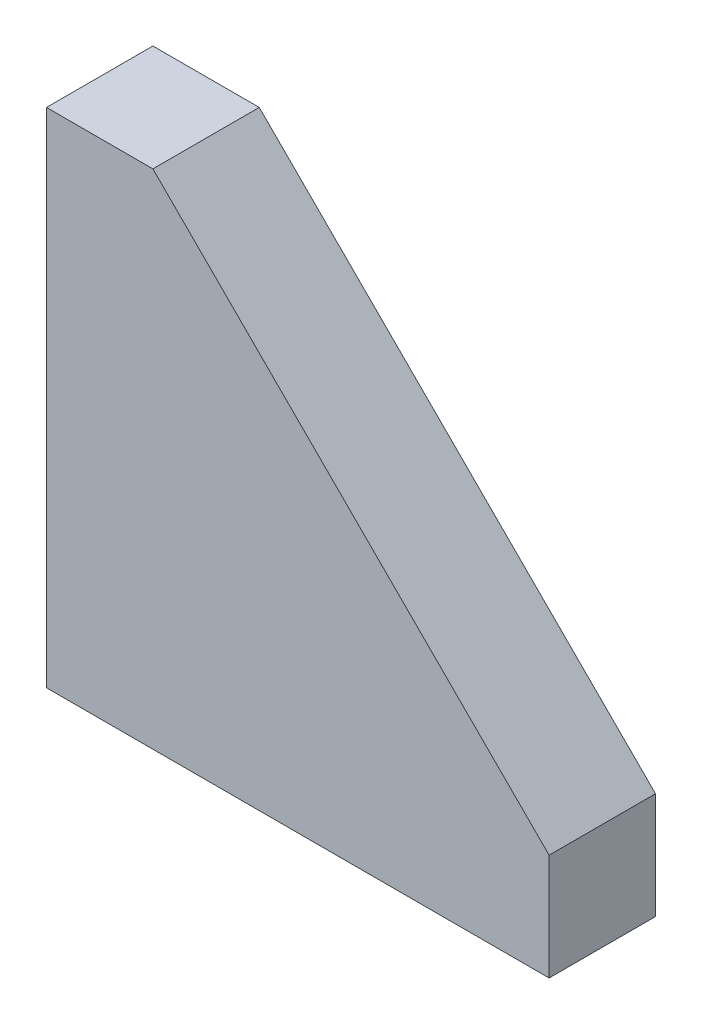
ISO-10303-21;
HEADER;
FILE_DESCRIPTION(('STEP AP214'),'2;1');
FILE_NAME('part.step','',(''),(''),'','','');
FILE_SCHEMA(('AUTOMOTIVE_DESIGN { 1 0 10303 214 1 1 1 1 }'));
ENDSEC;
DATA;
#1=APPLICATION_CONTEXT('core data for automotive mechanical design processes');
#2=APPLICATION_PROTOCOL_DEFINITION('international standard','automotive_design',2000,#1);
#3=PRODUCT_CONTEXT('',#1,'mechanical');
#4=PRODUCT('Part','Part','',(#3));
#5=PRODUCT_RELATED_PRODUCT_CATEGORY('part','',(#4));
#6=PRODUCT_DEFINITION_FORMATION('','',#4);
#7=PRODUCT_DEFINITION_CONTEXT('part definition',#1,'design');
#8=PRODUCT_DEFINITION('design','',#6,#7);
#9=PRODUCT_DEFINITION_SHAPE('','',#8);
#10=(LENGTH_UNIT() NAMED_UNIT(*) SI_UNIT(.MILLI.,.METRE.));
#11=(NAMED_UNIT(*) PLANE_ANGLE_UNIT() SI_UNIT($,.RADIAN.));
#12=(NAMED_UNIT(*) SI_UNIT($,.STERADIAN.) SOLID_ANGLE_UNIT());
#13=UNCERTAINTY_MEASURE_WITH_UNIT(LENGTH_MEASURE(1.E-05),#10,'distance_accuracy_value','');
#14=(GEOMETRIC_REPRESENTATION_CONTEXT(3) GLOBAL_UNCERTAINTY_ASSIGNED_CONTEXT((#13)) GLOBAL_UNIT_ASSIGNED_CONTEXT((#10,
#11,#12)) REPRESENTATION_CONTEXT('',''));
#15=CARTESIAN_POINT('',(0.,0.,0.));
#16=DIRECTION('',(0.,0.,1.));
#17=DIRECTION('',(1.,0.,0.));
#18=AXIS2_PLACEMENT_3D('',#15,#16,#17);
#19=CARTESIAN_POINT('',(30.,0.,6.35));
#20=DIRECTION('',(0.,1.,0.));
#21=DIRECTION('',(-1.,0.,0.));
#22=AXIS2_PLACEMENT_3D('',#19,#20,#21);
#23=PLANE('',#22);
#24=DIRECTION('',(1.,0.,0.));
#25=VECTOR('',#24,1.);
#26=CARTESIAN_POINT('',(30.,0.,0.));
#27=LINE('',#26,#25);
#28=CARTESIAN_POINT('',(0.,0.,0.));
#29=VERTEX_POINT('',#28);
#30=CARTESIAN_POINT('',(30.,0.,0.));
#31=VERTEX_POINT('',#30);
#32=EDGE_CURVE('E109',#29,#31,#27,.T.);
#33=ORIENTED_EDGE('',*,*,#32,.T.);
#34=DIRECTION('',(0.,0.,-1.));
#35=VECTOR('',#34,1.);
#36=CARTESIAN_POINT('',(30.,0.,6.35));
#37=LINE('',#36,#35);
#38=CARTESIAN_POINT('',(30.,0.,6.35));
#39=VERTEX_POINT('',#38);
#40=EDGE_CURVE('E11',#39,#31,#37,.T.);
#41=ORIENTED_EDGE('',*,*,#40,.F.);
#42=DIRECTION('',(1.,0.,0.));
#43=VECTOR('',#42,1.);
#44=CARTESIAN_POINT('',(30.,0.,6.35));
#45=LINE('',#44,#43);
#46=CARTESIAN_POINT('',(0.,0.,6.35));
#47=VERTEX_POINT('',#46);
#48=EDGE_CURVE('E117',#47,#39,#45,.T.);
#49=ORIENTED_EDGE('',*,*,#48,.F.);
#50=DIRECTION('',(0.,0.,-1.));
#51=VECTOR('',#50,1.);
#52=CARTESIAN_POINT('',(0.,0.,6.35));
#53=LINE('',#52,#51);
#54=EDGE_CURVE('E105',#47,#29,#53,.T.);
#55=ORIENTED_EDGE('',*,*,#54,.T.);
#56=EDGE_LOOP('',(#33,#41,#49,#55));
#57=FACE_BOUND('',#56,.T.);
#58=ADVANCED_FACE('F35',(#57),#23,.F.);
#59=CARTESIAN_POINT('',(30.,6.35,6.35));
#60=DIRECTION('',(-1.,0.,0.));
#61=DIRECTION('',(0.,0.,1.));
#62=AXIS2_PLACEMENT_3D('',#59,#60,#61);
#63=PLANE('',#62);
#64=DIRECTION('',(0.,1.,0.));
#65=VECTOR('',#64,1.);
#66=CARTESIAN_POINT('',(30.,6.35,0.));
#67=LINE('',#66,#65);
#68=CARTESIAN_POINT('',(30.,6.35,0.));
#69=VERTEX_POINT('',#68);
#70=EDGE_CURVE('E112',#31,#69,#67,.T.);
#71=ORIENTED_EDGE('',*,*,#70,.T.);
#72=DIRECTION('',(0.,0.,-1.));
#73=VECTOR('',#72,1.);
#74=CARTESIAN_POINT('',(30.,6.35,6.35));
#75=LINE('',#74,#73);
#76=CARTESIAN_POINT('',(30.,6.35,6.35));
#77=VERTEX_POINT('',#76);
#78=EDGE_CURVE('E43',#77,#69,#75,.T.);
#79=ORIENTED_EDGE('',*,*,#78,.F.);
#80=DIRECTION('',(0.,1.,0.));
#81=VECTOR('',#80,1.);
#82=CARTESIAN_POINT('',(30.,6.35,6.35));
#83=LINE('',#82,#81);
#84=EDGE_CURVE('E85',#39,#77,#83,.T.);
#85=ORIENTED_EDGE('',*,*,#84,.F.);
#86=ORIENTED_EDGE('',*,*,#40,.T.);
#87=EDGE_LOOP('',(#71,#79,#85,#86));
#88=FACE_BOUND('',#87,.T.);
#89=ADVANCED_FACE('F136',(#88),#63,.F.);
#90=CARTESIAN_POINT('',(6.35,30.,6.35));
#91=DIRECTION('',(-0.707106781186548,-0.707106781186548,0.));
#92=DIRECTION('',(0.707106781186548,-0.707106781186548,0.));
#93=AXIS2_PLACEMENT_3D('',#90,#91,#92);
#94=PLANE('',#93);
#95=DIRECTION('',(-0.707106781186548,0.707106781186548,0.));
#96=VECTOR('',#95,1.);
#97=CARTESIAN_POINT('',(6.35,30.,0.));
#98=LINE('',#97,#96);
#99=CARTESIAN_POINT('',(6.35,30.,0.));
#100=VERTEX_POINT('',#99);
#101=EDGE_CURVE('E100',#69,#100,#98,.T.);
#102=ORIENTED_EDGE('',*,*,#101,.T.);
#103=DIRECTION('',(0.,0.,-1.));
#104=VECTOR('',#103,1.);
#105=CARTESIAN_POINT('',(6.35,30.,6.35));
#106=LINE('',#105,#104);
#107=CARTESIAN_POINT('',(6.35,30.,6.35));
#108=VERTEX_POINT('',#107);
#109=EDGE_CURVE('E97',#108,#100,#106,.T.);
#110=ORIENTED_EDGE('',*,*,#109,.F.);
#111=DIRECTION('',(-0.707106781186548,0.707106781186548,0.));
#112=VECTOR('',#111,1.);
#113=CARTESIAN_POINT('',(6.35,30.,6.35));
#114=LINE('',#113,#112);
#115=EDGE_CURVE('E89',#77,#108,#114,.T.);
#116=ORIENTED_EDGE('',*,*,#115,.F.);
#117=ORIENTED_EDGE('',*,*,#78,.T.);
#118=EDGE_LOOP('',(#102,#110,#116,#117));
#119=FACE_BOUND('',#118,.T.);
#120=ADVANCED_FACE('F98',(#119),#94,.F.);
#121=CARTESIAN_POINT('',(0.,30.,6.35));
#122=DIRECTION('',(0.,-1.,0.));
#123=DIRECTION('',(0.,0.,-1.));
#124=AXIS2_PLACEMENT_3D('',#121,#122,#123);
#125=PLANE('',#124);
#126=DIRECTION('',(-1.,0.,0.));
#127=VECTOR('',#126,1.);
#128=CARTESIAN_POINT('',(0.,30.,0.));
#129=LINE('',#128,#127);
#130=CARTESIAN_POINT('',(0.,30.,0.));
#131=VERTEX_POINT('',#130);
#132=EDGE_CURVE('E71',#100,#131,#129,.T.);
#133=ORIENTED_EDGE('',*,*,#132,.T.);
#134=DIRECTION('',(0.,0.,-1.));
#135=VECTOR('',#134,1.);
#136=CARTESIAN_POINT('',(0.,30.,6.35));
#137=LINE('',#136,#135);
#138=CARTESIAN_POINT('',(0.,30.,6.35));
#139=VERTEX_POINT('',#138);
#140=EDGE_CURVE('E101',#139,#131,#137,.T.);
#141=ORIENTED_EDGE('',*,*,#140,.F.);
#142=DIRECTION('',(-1.,0.,0.));
#143=VECTOR('',#142,1.);
#144=CARTESIAN_POINT('',(0.,30.,6.35));
#145=LINE('',#144,#143);
#146=EDGE_CURVE('E93',#108,#139,#145,.T.);
#147=ORIENTED_EDGE('',*,*,#146,.F.);
#148=ORIENTED_EDGE('',*,*,#109,.T.);
#149=EDGE_LOOP('',(#133,#141,#147,#148));
#150=FACE_BOUND('',#149,.T.);
#151=ADVANCED_FACE('F103',(#150),#125,.F.);
#152=CARTESIAN_POINT('',(0.,0.,6.35));
#153=DIRECTION('',(1.,0.,0.));
#154=DIRECTION('',(0.,0.,-1.));
#155=AXIS2_PLACEMENT_3D('',#152,#153,#154);
#156=PLANE('',#155);
#157=DIRECTION('',(0.,-1.,0.));
#158=VECTOR('',#157,1.);
#159=CARTESIAN_POINT('',(0.,0.,0.));
#160=LINE('',#159,#158);
#161=EDGE_CURVE('E77',#131,#29,#160,.T.);
#162=ORIENTED_EDGE('',*,*,#161,.T.);
#163=ORIENTED_EDGE('',*,*,#54,.F.);
#164=DIRECTION('',(0.,-1.,0.));
#165=VECTOR('',#164,1.);
#166=CARTESIAN_POINT('',(0.,0.,6.35));
#167=LINE('',#166,#165);
#168=EDGE_CURVE('E51',#139,#47,#167,.T.);
#169=ORIENTED_EDGE('',*,*,#168,.F.);
#170=ORIENTED_EDGE('',*,*,#140,.T.);
#171=EDGE_LOOP('',(#162,#163,#169,#170));
#172=FACE_BOUND('',#171,.T.);
#173=ADVANCED_FACE('F125',(#172),#156,.F.);
#174=CARTESIAN_POINT('',(0.,0.,6.35));
#175=DIRECTION('',(0.,0.,-1.));
#176=DIRECTION('',(-1.,0.,0.));
#177=AXIS2_PLACEMENT_3D('',#174,#175,#176);
#178=PLANE('',#177);
#179=ORIENTED_EDGE('',*,*,#48,.T.);
#180=ORIENTED_EDGE('',*,*,#84,.T.);
#181=ORIENTED_EDGE('',*,*,#115,.T.);
#182=ORIENTED_EDGE('',*,*,#146,.T.);
#183=ORIENTED_EDGE('',*,*,#168,.T.);
#184=EDGE_LOOP('',(#179,#180,#181,#182,#183));
#185=FACE_BOUND('',#184,.T.);
#186=ADVANCED_FACE('F91',(#185),#178,.F.);
#187=CARTESIAN_POINT('',(0.,0.,0.));
#188=DIRECTION('',(0.,0.,-1.));
#189=DIRECTION('',(-1.,0.,0.));
#190=AXIS2_PLACEMENT_3D('',#187,#188,#189);
#191=PLANE('',#190);
#192=ORIENTED_EDGE('',*,*,#32,.F.);
#193=ORIENTED_EDGE('',*,*,#161,.F.);
#194=ORIENTED_EDGE('',*,*,#132,.F.);
#195=ORIENTED_EDGE('',*,*,#101,.F.);
#196=ORIENTED_EDGE('',*,*,#70,.F.);
#197=EDGE_LOOP('',(#192,#193,#194,#195,#196));
#198=FACE_BOUND('',#197,.T.);
#199=ADVANCED_FACE('F121',(#198),#191,.T.);
#200=CLOSED_SHELL('',(#58,#89,#120,#151,#173,#186,#199));
#201=MANIFOLD_SOLID_BREP('B2',#200);
#202=ADVANCED_BREP_SHAPE_REPRESENTATION('',(#18,#201),#14);
#203=SHAPE_DEFINITION_REPRESENTATION(#9,#202);
ENDSEC;
END-ISO-10303-21;
